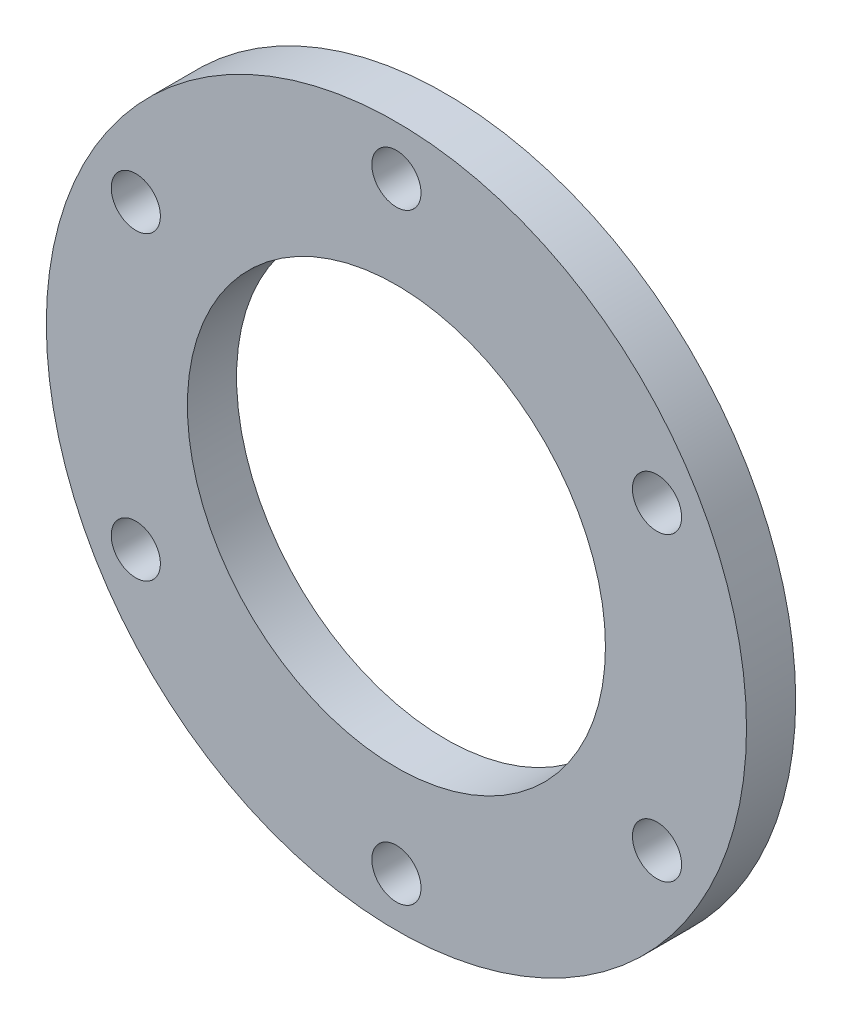
ISO-10303-21;
HEADER;
FILE_DESCRIPTION(('STEP AP214'),'2;1');
FILE_NAME('part.step','',(''),(''),'','','');
FILE_SCHEMA(('AUTOMOTIVE_DESIGN { 1 0 10303 214 1 1 1 1 }'));
ENDSEC;
DATA;
#1=APPLICATION_CONTEXT('core data for automotive mechanical design processes');
#2=APPLICATION_PROTOCOL_DEFINITION('international standard','automotive_design',2000,#1);
#3=PRODUCT_CONTEXT('',#1,'mechanical');
#4=PRODUCT('Part','Part','',(#3));
#5=PRODUCT_RELATED_PRODUCT_CATEGORY('part','',(#4));
#6=PRODUCT_DEFINITION_FORMATION('','',#4);
#7=PRODUCT_DEFINITION_CONTEXT('part definition',#1,'design');
#8=PRODUCT_DEFINITION('design','',#6,#7);
#9=PRODUCT_DEFINITION_SHAPE('','',#8);
#10=(LENGTH_UNIT() NAMED_UNIT(*) SI_UNIT(.MILLI.,.METRE.));
#11=(NAMED_UNIT(*) PLANE_ANGLE_UNIT() SI_UNIT($,.RADIAN.));
#12=(NAMED_UNIT(*) SI_UNIT($,.STERADIAN.) SOLID_ANGLE_UNIT());
#13=UNCERTAINTY_MEASURE_WITH_UNIT(LENGTH_MEASURE(1.E-05),#10,'distance_accuracy_value','');
#14=(GEOMETRIC_REPRESENTATION_CONTEXT(3) GLOBAL_UNCERTAINTY_ASSIGNED_CONTEXT((#13)) GLOBAL_UNIT_ASSIGNED_CONTEXT((#10,
#11,#12)) REPRESENTATION_CONTEXT('',''));
#15=CARTESIAN_POINT('',(0.,0.,0.));
#16=DIRECTION('',(0.,0.,1.));
#17=DIRECTION('',(1.,0.,0.));
#18=AXIS2_PLACEMENT_3D('',#15,#16,#17);
#19=CARTESIAN_POINT('',(0.,0.,6.35));
#20=DIRECTION('',(0.,0.,1.));
#21=DIRECTION('',(1.,0.,0.));
#22=AXIS2_PLACEMENT_3D('',#19,#20,#21);
#23=PLANE('',#22);
#24=CARTESIAN_POINT('',(-33.64509663651,-19.4250056,6.35));
#25=DIRECTION('',(0.,0.,1.));
#26=DIRECTION('',(1.,0.,0.));
#27=AXIS2_PLACEMENT_3D('',#24,#25,#26);
#28=CIRCLE('',#27,3.175);
#29=CARTESIAN_POINT('',(-30.47009663651,-19.4250056,6.35));
#30=VERTEX_POINT('',#29);
#31=EDGE_CURVE('E94',#30,#30,#28,.T.);
#32=ORIENTED_EDGE('',*,*,#31,.F.);
#33=EDGE_LOOP('',(#32));
#34=FACE_BOUND('',#33,.T.);
#35=CARTESIAN_POINT('',(33.64509663651,-19.4250056,6.35));
#36=DIRECTION('',(0.,0.,1.));
#37=DIRECTION('',(1.,0.,0.));
#38=AXIS2_PLACEMENT_3D('',#35,#36,#37);
#39=CIRCLE('',#38,3.175);
#40=CARTESIAN_POINT('',(36.82009663651,-19.4250056,6.35));
#41=VERTEX_POINT('',#40);
#42=EDGE_CURVE('E78',#41,#41,#39,.T.);
#43=ORIENTED_EDGE('',*,*,#42,.F.);
#44=EDGE_LOOP('',(#43));
#45=FACE_BOUND('',#44,.T.);
#46=CARTESIAN_POINT('',(0.,38.8500112,6.35));
#47=DIRECTION('',(0.,0.,1.));
#48=DIRECTION('',(1.,0.,0.));
#49=AXIS2_PLACEMENT_3D('',#46,#47,#48);
#50=CIRCLE('',#49,3.175);
#51=CARTESIAN_POINT('',(3.175,38.8500112,6.35));
#52=VERTEX_POINT('',#51);
#53=EDGE_CURVE('E62',#52,#52,#50,.T.);
#54=ORIENTED_EDGE('',*,*,#53,.F.);
#55=EDGE_LOOP('',(#54));
#56=FACE_BOUND('',#55,.T.);
#57=CARTESIAN_POINT('',(0.,0.,6.35));
#58=DIRECTION('',(0.,0.,1.));
#59=DIRECTION('',(1.,0.,0.));
#60=AXIS2_PLACEMENT_3D('',#57,#58,#59);
#61=CIRCLE('',#60,45.2);
#62=CARTESIAN_POINT('',(45.2,0.,6.35));
#63=VERTEX_POINT('',#62);
#64=EDGE_CURVE('E10',#63,#63,#61,.T.);
#65=ORIENTED_EDGE('',*,*,#64,.T.);
#66=EDGE_LOOP('',(#65));
#67=FACE_BOUND('',#66,.T.);
#68=CARTESIAN_POINT('',(0.,0.,6.35));
#69=DIRECTION('',(0.,0.,1.));
#70=DIRECTION('',(1.,0.,0.));
#71=AXIS2_PLACEMENT_3D('',#68,#69,#70);
#72=CIRCLE('',#71,26.9875);
#73=CARTESIAN_POINT('',(26.9875,0.,6.35));
#74=VERTEX_POINT('',#73);
#75=EDGE_CURVE('E56',#74,#74,#72,.T.);
#76=ORIENTED_EDGE('',*,*,#75,.F.);
#77=EDGE_LOOP('',(#76));
#78=FACE_BOUND('',#77,.T.);
#79=CARTESIAN_POINT('',(33.64509663651,19.4250056,6.35));
#80=DIRECTION('',(0.,0.,1.));
#81=DIRECTION('',(1.,0.,0.));
#82=AXIS2_PLACEMENT_3D('',#79,#80,#81);
#83=CIRCLE('',#82,3.175);
#84=CARTESIAN_POINT('',(36.82009663651,19.4250056,6.35));
#85=VERTEX_POINT('',#84);
#86=EDGE_CURVE('E70',#85,#85,#83,.T.);
#87=ORIENTED_EDGE('',*,*,#86,.F.);
#88=EDGE_LOOP('',(#87));
#89=FACE_BOUND('',#88,.T.);
#90=CARTESIAN_POINT('',(0.,-38.8500112,6.35));
#91=DIRECTION('',(0.,0.,1.));
#92=DIRECTION('',(1.,0.,0.));
#93=AXIS2_PLACEMENT_3D('',#90,#91,#92);
#94=CIRCLE('',#93,3.175);
#95=CARTESIAN_POINT('',(3.175,-38.8500112,6.35));
#96=VERTEX_POINT('',#95);
#97=EDGE_CURVE('E86',#96,#96,#94,.T.);
#98=ORIENTED_EDGE('',*,*,#97,.F.);
#99=EDGE_LOOP('',(#98));
#100=FACE_BOUND('',#99,.T.);
#101=CARTESIAN_POINT('',(-33.64509663651,19.4250056,6.35));
#102=DIRECTION('',(0.,0.,1.));
#103=DIRECTION('',(1.,0.,0.));
#104=AXIS2_PLACEMENT_3D('',#101,#102,#103);
#105=CIRCLE('',#104,3.175);
#106=CARTESIAN_POINT('',(-30.47009663651,19.4250056,6.35));
#107=VERTEX_POINT('',#106);
#108=EDGE_CURVE('E102',#107,#107,#105,.T.);
#109=ORIENTED_EDGE('',*,*,#108,.F.);
#110=EDGE_LOOP('',(#109));
#111=FACE_BOUND('',#110,.T.);
#112=ADVANCED_FACE('F43',(#34,#45,#56,#67,#78,#89,#100,#111),#23,.T.);
#113=CARTESIAN_POINT('',(0.,0.,0.));
#114=DIRECTION('',(0.,0.,1.));
#115=DIRECTION('',(1.,0.,0.));
#116=AXIS2_PLACEMENT_3D('',#113,#114,#115);
#117=PLANE('',#116);
#118=CARTESIAN_POINT('',(0.,0.,0.));
#119=DIRECTION('',(0.,0.,1.));
#120=DIRECTION('',(1.,0.,0.));
#121=AXIS2_PLACEMENT_3D('',#118,#119,#120);
#122=CIRCLE('',#121,45.2);
#123=CARTESIAN_POINT('',(45.2,0.,0.));
#124=VERTEX_POINT('',#123);
#125=EDGE_CURVE('E47',#124,#124,#122,.T.);
#126=ORIENTED_EDGE('',*,*,#125,.F.);
#127=EDGE_LOOP('',(#126));
#128=FACE_BOUND('',#127,.T.);
#129=CARTESIAN_POINT('',(0.,0.,0.));
#130=DIRECTION('',(0.,0.,1.));
#131=DIRECTION('',(1.,0.,0.));
#132=AXIS2_PLACEMENT_3D('',#129,#130,#131);
#133=CIRCLE('',#132,26.9875);
#134=CARTESIAN_POINT('',(26.9875,0.,0.));
#135=VERTEX_POINT('',#134);
#136=EDGE_CURVE('E58',#135,#135,#133,.T.);
#137=ORIENTED_EDGE('',*,*,#136,.T.);
#138=EDGE_LOOP('',(#137));
#139=FACE_BOUND('',#138,.T.);
#140=CARTESIAN_POINT('',(0.,38.8500112,0.));
#141=DIRECTION('',(0.,0.,1.));
#142=DIRECTION('',(1.,0.,0.));
#143=AXIS2_PLACEMENT_3D('',#140,#141,#142);
#144=CIRCLE('',#143,3.175);
#145=CARTESIAN_POINT('',(3.175,38.8500112,0.));
#146=VERTEX_POINT('',#145);
#147=EDGE_CURVE('E66',#146,#146,#144,.T.);
#148=ORIENTED_EDGE('',*,*,#147,.T.);
#149=EDGE_LOOP('',(#148));
#150=FACE_BOUND('',#149,.T.);
#151=CARTESIAN_POINT('',(33.64509663651,19.4250056,0.));
#152=DIRECTION('',(0.,0.,1.));
#153=DIRECTION('',(1.,0.,0.));
#154=AXIS2_PLACEMENT_3D('',#151,#152,#153);
#155=CIRCLE('',#154,3.175);
#156=CARTESIAN_POINT('',(36.82009663651,19.4250056,0.));
#157=VERTEX_POINT('',#156);
#158=EDGE_CURVE('E74',#157,#157,#155,.T.);
#159=ORIENTED_EDGE('',*,*,#158,.T.);
#160=EDGE_LOOP('',(#159));
#161=FACE_BOUND('',#160,.T.);
#162=CARTESIAN_POINT('',(33.64509663651,-19.4250056,0.));
#163=DIRECTION('',(0.,0.,1.));
#164=DIRECTION('',(1.,0.,0.));
#165=AXIS2_PLACEMENT_3D('',#162,#163,#164);
#166=CIRCLE('',#165,3.175);
#167=CARTESIAN_POINT('',(36.82009663651,-19.4250056,0.));
#168=VERTEX_POINT('',#167);
#169=EDGE_CURVE('E82',#168,#168,#166,.T.);
#170=ORIENTED_EDGE('',*,*,#169,.T.);
#171=EDGE_LOOP('',(#170));
#172=FACE_BOUND('',#171,.T.);
#173=CARTESIAN_POINT('',(0.,-38.8500112,0.));
#174=DIRECTION('',(0.,0.,1.));
#175=DIRECTION('',(1.,0.,0.));
#176=AXIS2_PLACEMENT_3D('',#173,#174,#175);
#177=CIRCLE('',#176,3.175);
#178=CARTESIAN_POINT('',(3.175,-38.8500112,0.));
#179=VERTEX_POINT('',#178);
#180=EDGE_CURVE('E90',#179,#179,#177,.T.);
#181=ORIENTED_EDGE('',*,*,#180,.T.);
#182=EDGE_LOOP('',(#181));
#183=FACE_BOUND('',#182,.T.);
#184=CARTESIAN_POINT('',(-33.64509663651,-19.4250056,0.));
#185=DIRECTION('',(0.,0.,1.));
#186=DIRECTION('',(1.,0.,0.));
#187=AXIS2_PLACEMENT_3D('',#184,#185,#186);
#188=CIRCLE('',#187,3.175);
#189=CARTESIAN_POINT('',(-30.47009663651,-19.4250056,0.));
#190=VERTEX_POINT('',#189);
#191=EDGE_CURVE('E98',#190,#190,#188,.T.);
#192=ORIENTED_EDGE('',*,*,#191,.T.);
#193=EDGE_LOOP('',(#192));
#194=FACE_BOUND('',#193,.T.);
#195=CARTESIAN_POINT('',(-33.64509663651,19.4250056,0.));
#196=DIRECTION('',(0.,0.,1.));
#197=DIRECTION('',(1.,0.,0.));
#198=AXIS2_PLACEMENT_3D('',#195,#196,#197);
#199=CIRCLE('',#198,3.175);
#200=CARTESIAN_POINT('',(-30.47009663651,19.4250056,0.));
#201=VERTEX_POINT('',#200);
#202=EDGE_CURVE('E106',#201,#201,#199,.T.);
#203=ORIENTED_EDGE('',*,*,#202,.T.);
#204=EDGE_LOOP('',(#203));
#205=FACE_BOUND('',#204,.T.);
#206=ADVANCED_FACE('F118',(#128,#139,#150,#161,#172,#183,#194,#205),#117,.F.);
#207=CARTESIAN_POINT('',(0.,0.,6.35));
#208=DIRECTION('',(0.,0.,-1.));
#209=DIRECTION('',(-1.,0.,0.));
#210=AXIS2_PLACEMENT_3D('',#207,#208,#209);
#211=CYLINDRICAL_SURFACE('',#210,45.2);
#212=ORIENTED_EDGE('',*,*,#64,.F.);
#213=EDGE_LOOP('',(#212));
#214=FACE_BOUND('',#213,.T.);
#215=ORIENTED_EDGE('',*,*,#125,.T.);
#216=EDGE_LOOP('',(#215));
#217=FACE_BOUND('',#216,.T.);
#218=ADVANCED_FACE('F45',(#214,#217),#211,.T.);
#219=CARTESIAN_POINT('',(0.,0.,6.35));
#220=DIRECTION('',(0.,0.,-1.));
#221=DIRECTION('',(-1.,0.,0.));
#222=AXIS2_PLACEMENT_3D('',#219,#220,#221);
#223=CYLINDRICAL_SURFACE('',#222,26.9875);
#224=ORIENTED_EDGE('',*,*,#75,.T.);
#225=EDGE_LOOP('',(#224));
#226=FACE_BOUND('',#225,.T.);
#227=ORIENTED_EDGE('',*,*,#136,.F.);
#228=EDGE_LOOP('',(#227));
#229=FACE_BOUND('',#228,.T.);
#230=ADVANCED_FACE('F128',(#226,#229),#223,.F.);
#231=CARTESIAN_POINT('',(0.,38.8500112,6.35));
#232=DIRECTION('',(0.,0.,-1.));
#233=DIRECTION('',(-1.,0.,0.));
#234=AXIS2_PLACEMENT_3D('',#231,#232,#233);
#235=CYLINDRICAL_SURFACE('',#234,3.175);
#236=ORIENTED_EDGE('',*,*,#53,.T.);
#237=EDGE_LOOP('',(#236));
#238=FACE_BOUND('',#237,.T.);
#239=ORIENTED_EDGE('',*,*,#147,.F.);
#240=EDGE_LOOP('',(#239));
#241=FACE_BOUND('',#240,.T.);
#242=ADVANCED_FACE('F131',(#238,#241),#235,.F.);
#243=CARTESIAN_POINT('',(33.64509663651,19.4250056,6.35));
#244=DIRECTION('',(0.,0.,-1.));
#245=DIRECTION('',(-1.,0.,0.));
#246=AXIS2_PLACEMENT_3D('',#243,#244,#245);
#247=CYLINDRICAL_SURFACE('',#246,3.175);
#248=ORIENTED_EDGE('',*,*,#86,.T.);
#249=EDGE_LOOP('',(#248));
#250=FACE_BOUND('',#249,.T.);
#251=ORIENTED_EDGE('',*,*,#158,.F.);
#252=EDGE_LOOP('',(#251));
#253=FACE_BOUND('',#252,.T.);
#254=ADVANCED_FACE('F135',(#250,#253),#247,.F.);
#255=CARTESIAN_POINT('',(33.64509663651,-19.4250056,6.35));
#256=DIRECTION('',(0.,0.,-1.));
#257=DIRECTION('',(-1.,0.,0.));
#258=AXIS2_PLACEMENT_3D('',#255,#256,#257);
#259=CYLINDRICAL_SURFACE('',#258,3.175);
#260=ORIENTED_EDGE('',*,*,#42,.T.);
#261=EDGE_LOOP('',(#260));
#262=FACE_BOUND('',#261,.T.);
#263=ORIENTED_EDGE('',*,*,#169,.F.);
#264=EDGE_LOOP('',(#263));
#265=FACE_BOUND('',#264,.T.);
#266=ADVANCED_FACE('F139',(#262,#265),#259,.F.);
#267=CARTESIAN_POINT('',(0.,-38.8500112,6.35));
#268=DIRECTION('',(0.,0.,-1.));
#269=DIRECTION('',(-1.,0.,0.));
#270=AXIS2_PLACEMENT_3D('',#267,#268,#269);
#271=CYLINDRICAL_SURFACE('',#270,3.175);
#272=ORIENTED_EDGE('',*,*,#97,.T.);
#273=EDGE_LOOP('',(#272));
#274=FACE_BOUND('',#273,.T.);
#275=ORIENTED_EDGE('',*,*,#180,.F.);
#276=EDGE_LOOP('',(#275));
#277=FACE_BOUND('',#276,.T.);
#278=ADVANCED_FACE('F143',(#274,#277),#271,.F.);
#279=CARTESIAN_POINT('',(-33.64509663651,-19.4250056,6.35));
#280=DIRECTION('',(0.,0.,-1.));
#281=DIRECTION('',(-1.,0.,0.));
#282=AXIS2_PLACEMENT_3D('',#279,#280,#281);
#283=CYLINDRICAL_SURFACE('',#282,3.175);
#284=ORIENTED_EDGE('',*,*,#31,.T.);
#285=EDGE_LOOP('',(#284));
#286=FACE_BOUND('',#285,.T.);
#287=ORIENTED_EDGE('',*,*,#191,.F.);
#288=EDGE_LOOP('',(#287));
#289=FACE_BOUND('',#288,.T.);
#290=ADVANCED_FACE('F147',(#286,#289),#283,.F.);
#291=CARTESIAN_POINT('',(-33.64509663651,19.4250056,6.35));
#292=DIRECTION('',(0.,0.,-1.));
#293=DIRECTION('',(-1.,0.,0.));
#294=AXIS2_PLACEMENT_3D('',#291,#292,#293);
#295=CYLINDRICAL_SURFACE('',#294,3.175);
#296=ORIENTED_EDGE('',*,*,#108,.T.);
#297=EDGE_LOOP('',(#296));
#298=FACE_BOUND('',#297,.T.);
#299=ORIENTED_EDGE('',*,*,#202,.F.);
#300=EDGE_LOOP('',(#299));
#301=FACE_BOUND('',#300,.T.);
#302=ADVANCED_FACE('F114',(#298,#301),#295,.F.);
#303=CLOSED_SHELL('',(#112,#206,#218,#230,#242,#254,#266,#278,#290,#302));
#304=MANIFOLD_SOLID_BREP('B2',#303);
#305=ADVANCED_BREP_SHAPE_REPRESENTATION('',(#18,#304),#14);
#306=SHAPE_DEFINITION_REPRESENTATION(#9,#305);
ENDSEC;
END-ISO-10303-21;
